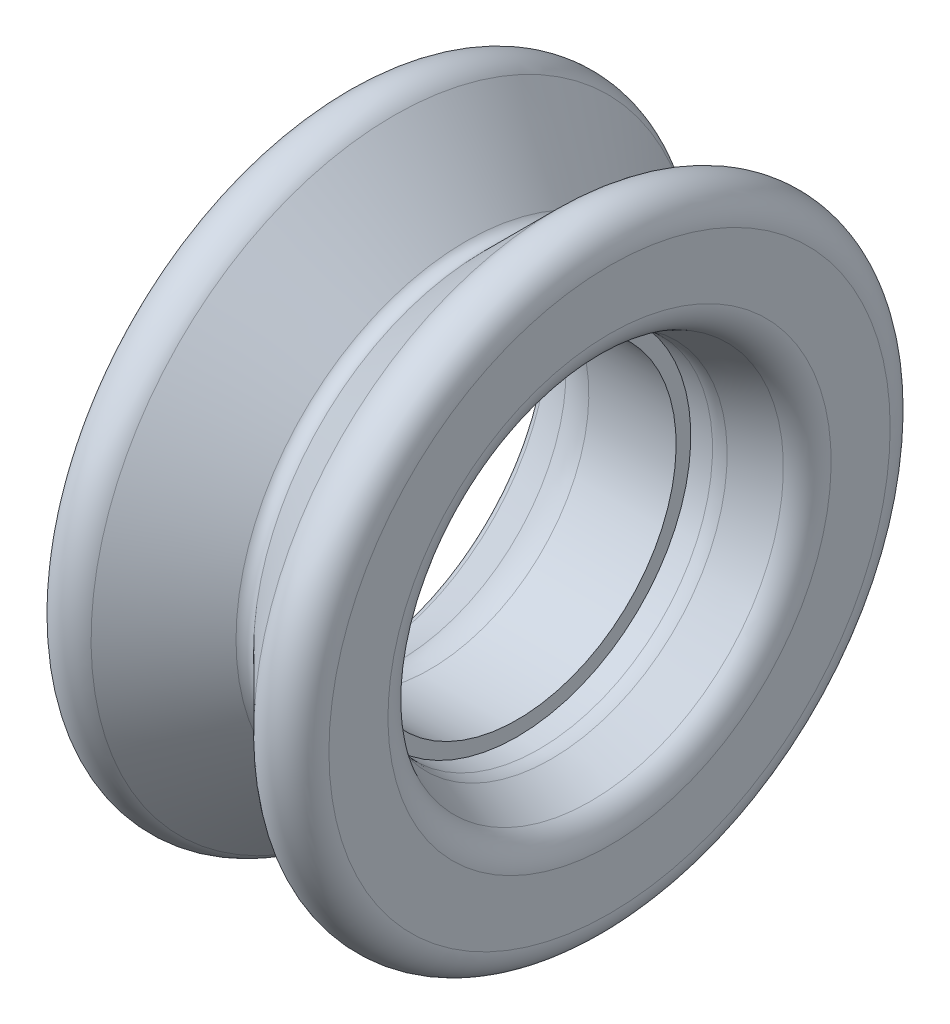
ISO-10303-21;
HEADER;
FILE_DESCRIPTION(('STEP AP214'),'2;1');
FILE_NAME('part.step','',(''),(''),'','','');
FILE_SCHEMA(('AUTOMOTIVE_DESIGN { 1 0 10303 214 1 1 1 1 }'));
ENDSEC;
DATA;
#1=APPLICATION_CONTEXT('core data for automotive mechanical design processes');
#2=APPLICATION_PROTOCOL_DEFINITION('international standard','automotive_design',2000,#1);
#3=PRODUCT_CONTEXT('',#1,'mechanical');
#4=PRODUCT('Part','Part','',(#3));
#5=PRODUCT_RELATED_PRODUCT_CATEGORY('part','',(#4));
#6=PRODUCT_DEFINITION_FORMATION('','',#4);
#7=PRODUCT_DEFINITION_CONTEXT('part definition',#1,'design');
#8=PRODUCT_DEFINITION('design','',#6,#7);
#9=PRODUCT_DEFINITION_SHAPE('','',#8);
#10=(LENGTH_UNIT() NAMED_UNIT(*) SI_UNIT(.MILLI.,.METRE.));
#11=(NAMED_UNIT(*) PLANE_ANGLE_UNIT() SI_UNIT($,.RADIAN.));
#12=(NAMED_UNIT(*) SI_UNIT($,.STERADIAN.) SOLID_ANGLE_UNIT());
#13=UNCERTAINTY_MEASURE_WITH_UNIT(LENGTH_MEASURE(1.E-05),#10,'distance_accuracy_value','');
#14=(GEOMETRIC_REPRESENTATION_CONTEXT(3) GLOBAL_UNCERTAINTY_ASSIGNED_CONTEXT((#13)) GLOBAL_UNIT_ASSIGNED_CONTEXT((#10,
#11,#12)) REPRESENTATION_CONTEXT('',''));
#15=CARTESIAN_POINT('',(0.,0.,0.));
#16=DIRECTION('',(0.,0.,1.));
#17=DIRECTION('',(1.,0.,0.));
#18=AXIS2_PLACEMENT_3D('',#15,#16,#17);
#19=CARTESIAN_POINT('',(-1.143,6.477,0.));
#20=DIRECTION('',(1.,0.,0.));
#21=DIRECTION('',(0.,1.,0.));
#22=AXIS2_PLACEMENT_3D('',#19,#20,#21);
#23=PLANE('',#22);
#24=CARTESIAN_POINT('',(-1.143,0.,0.));
#25=DIRECTION('',(1.,0.,0.));
#26=DIRECTION('',(0.,1.,0.));
#27=AXIS2_PLACEMENT_3D('',#24,#25,#26);
#28=CIRCLE('',#27,7.0739);
#29=CARTESIAN_POINT('',(-1.143,7.0739,0.));
#30=VERTEX_POINT('',#29);
#31=EDGE_CURVE('E84',#30,#30,#28,.T.);
#32=ORIENTED_EDGE('',*,*,#31,.T.);
#33=EDGE_LOOP('',(#32));
#34=FACE_BOUND('',#33,.T.);
#35=CARTESIAN_POINT('',(-1.143,0.,0.));
#36=DIRECTION('',(1.,0.,0.));
#37=DIRECTION('',(0.,1.,0.));
#38=AXIS2_PLACEMENT_3D('',#35,#36,#37);
#39=CIRCLE('',#38,6.477);
#40=CARTESIAN_POINT('',(-1.143,6.477,0.));
#41=VERTEX_POINT('',#40);
#42=EDGE_CURVE('E57',#41,#41,#39,.T.);
#43=ORIENTED_EDGE('',*,*,#42,.F.);
#44=EDGE_LOOP('',(#43));
#45=FACE_BOUND('',#44,.T.);
#46=ADVANCED_FACE('F31',(#34,#45),#23,.T.);
#47=CARTESIAN_POINT('',(0.,0.,0.));
#48=DIRECTION('',(1.,0.,0.));
#49=DIRECTION('',(0.,1.,0.));
#50=AXIS2_PLACEMENT_3D('',#47,#48,#49);
#51=CYLINDRICAL_SURFACE('',#50,6.477);
#52=ORIENTED_EDGE('',*,*,#42,.T.);
#53=EDGE_LOOP('',(#52));
#54=FACE_BOUND('',#53,.T.);
#55=CARTESIAN_POINT('',(-4.699,0.,0.));
#56=DIRECTION('',(1.,0.,0.));
#57=DIRECTION('',(0.,1.,0.));
#58=AXIS2_PLACEMENT_3D('',#55,#56,#57);
#59=CIRCLE('',#58,6.477);
#60=CARTESIAN_POINT('',(-4.699,6.477,0.));
#61=VERTEX_POINT('',#60);
#62=EDGE_CURVE('E60',#61,#61,#59,.T.);
#63=ORIENTED_EDGE('',*,*,#62,.F.);
#64=EDGE_LOOP('',(#63));
#65=FACE_BOUND('',#64,.T.);
#66=ADVANCED_FACE('F105',(#54,#65),#51,.F.);
#67=CARTESIAN_POINT('',(-4.699,0.,0.));
#68=DIRECTION('',(1.,0.,0.));
#69=DIRECTION('',(0.,1.,0.));
#70=AXIS2_PLACEMENT_3D('',#67,#68,#69);
#71=TOROIDAL_SURFACE('',#70,9.017,2.54);
#72=ORIENTED_EDGE('',*,*,#62,.T.);
#73=EDGE_LOOP('',(#72));
#74=FACE_BOUND('',#73,.T.);
#75=CARTESIAN_POINT('',(-5.969,0.,0.));
#76=DIRECTION('',(1.,0.,0.));
#77=DIRECTION('',(0.,1.,0.));
#78=AXIS2_PLACEMENT_3D('',#75,#76,#77);
#79=CIRCLE('',#78,6.81729547438753);
#80=CARTESIAN_POINT('',(-5.969,6.81729547438753,0.));
#81=VERTEX_POINT('',#80);
#82=EDGE_CURVE('E63',#81,#81,#79,.T.);
#83=ORIENTED_EDGE('',*,*,#82,.F.);
#84=EDGE_LOOP('',(#83));
#85=FACE_BOUND('',#84,.T.);
#86=ADVANCED_FACE('F110',(#74,#85),#71,.T.);
#87=CARTESIAN_POINT('',(-8.33655122421382,0.,0.));
#88=DIRECTION('',(-1.,0.,0.));
#89=DIRECTION('',(0.,-1.,0.));
#90=AXIS2_PLACEMENT_3D('',#87,#88,#89);
#91=CONICAL_SURFACE('',#90,8.18420181100761,0.5235987755983);
#92=CARTESIAN_POINT('',(-7.70155122421382,0.,0.));
#93=DIRECTION('',(1.,0.,0.));
#94=DIRECTION('',(0.,1.,0.));
#95=AXIS2_PLACEMENT_3D('',#92,#93,#94);
#96=CIRCLE('',#95,7.8175843900722);
#97=CARTESIAN_POINT('',(-7.70155122421382,7.8175843900722,0.));
#98=VERTEX_POINT('',#97);
#99=EDGE_CURVE('E42',#98,#98,#96,.F.);
#100=ORIENTED_EDGE('',*,*,#99,.T.);
#101=EDGE_LOOP('',(#100));
#102=FACE_BOUND('',#101,.T.);
#103=ORIENTED_EDGE('',*,*,#82,.T.);
#104=EDGE_LOOP('',(#103));
#105=FACE_BOUND('',#104,.T.);
#106=ADVANCED_FACE('F128',(#102,#105),#91,.F.);
#107=CARTESIAN_POINT('',(-8.33655122421382,11.43,0.));
#108=DIRECTION('',(-1.,0.,0.));
#109=DIRECTION('',(0.,-1.,0.));
#110=AXIS2_PLACEMENT_3D('',#107,#108,#109);
#111=PLANE('',#110);
#112=CARTESIAN_POINT('',(-8.33655122421382,0.,0.));
#113=DIRECTION('',(-1.,0.,0.));
#114=DIRECTION('',(0.,-1.,0.));
#115=AXIS2_PLACEMENT_3D('',#112,#113,#114);
#116=CIRCLE('',#115,8.91743665287843);
#117=CARTESIAN_POINT('',(-8.33655122421382,-8.91743665287844,0.));
#118=VERTEX_POINT('',#117);
#119=EDGE_CURVE('E46',#118,#118,#116,.F.);
#120=ORIENTED_EDGE('',*,*,#119,.T.);
#121=EDGE_LOOP('',(#120));
#122=FACE_BOUND('',#121,.T.);
#123=CARTESIAN_POINT('',(-8.33655122421382,0.,0.));
#124=DIRECTION('',(1.,0.,0.));
#125=DIRECTION('',(0.,1.,0.));
#126=AXIS2_PLACEMENT_3D('',#123,#124,#125);
#127=CIRCLE('',#126,11.43);
#128=CARTESIAN_POINT('',(-8.33655122421382,11.43,0.));
#129=VERTEX_POINT('',#128);
#130=EDGE_CURVE('E66',#129,#129,#127,.T.);
#131=ORIENTED_EDGE('',*,*,#130,.F.);
#132=EDGE_LOOP('',(#131));
#133=FACE_BOUND('',#132,.T.);
#134=ADVANCED_FACE('F124',(#122,#133),#111,.T.);
#135=CARTESIAN_POINT('',(-7.06655122421382,0.,0.));
#136=DIRECTION('',(1.,0.,0.));
#137=DIRECTION('',(0.,1.,0.));
#138=AXIS2_PLACEMENT_3D('',#135,#136,#137);
#139=TOROIDAL_SURFACE('',#138,11.43,1.27);
#140=ORIENTED_EDGE('',*,*,#130,.T.);
#141=EDGE_LOOP('',(#140));
#142=FACE_BOUND('',#141,.T.);
#143=CARTESIAN_POINT('',(-6.1685256121069,0.,0.));
#144=DIRECTION('',(1.,0.,0.));
#145=DIRECTION('',(0.,1.,0.));
#146=AXIS2_PLACEMENT_3D('',#143,#144,#145);
#147=CIRCLE('',#146,12.3280256121069);
#148=CARTESIAN_POINT('',(-6.1685256121069,12.3280256121069,0.));
#149=VERTEX_POINT('',#148);
#150=EDGE_CURVE('E69',#149,#149,#147,.T.);
#151=ORIENTED_EDGE('',*,*,#150,.F.);
#152=EDGE_LOOP('',(#151));
#153=FACE_BOUND('',#152,.T.);
#154=ADVANCED_FACE('F127',(#142,#153),#139,.T.);
#155=CARTESIAN_POINT('',(-3.21671024484277,0.,0.));
#156=DIRECTION('',(-1.,0.,0.));
#157=DIRECTION('',(0.,-1.,0.));
#158=AXIS2_PLACEMENT_3D('',#155,#156,#157);
#159=CONICAL_SURFACE('',#158,9.37621024484277,0.78539816339745);
#160=ORIENTED_EDGE('',*,*,#150,.T.);
#161=EDGE_LOOP('',(#160));
#162=FACE_BOUND('',#161,.T.);
#163=CARTESIAN_POINT('',(-3.21671024484277,0.,0.));
#164=DIRECTION('',(1.,0.,0.));
#165=DIRECTION('',(0.,1.,0.));
#166=AXIS2_PLACEMENT_3D('',#163,#164,#165);
#167=CIRCLE('',#166,9.37621024484277);
#168=CARTESIAN_POINT('',(-3.21671024484277,9.37621024484277,0.));
#169=VERTEX_POINT('',#168);
#170=EDGE_CURVE('E72',#169,#169,#167,.T.);
#171=ORIENTED_EDGE('',*,*,#170,.F.);
#172=EDGE_LOOP('',(#171));
#173=FACE_BOUND('',#172,.T.);
#174=ADVANCED_FACE('F134',(#162,#173),#159,.T.);
#175=CARTESIAN_POINT('',(-2.8575,0.,0.));
#176=DIRECTION('',(1.,0.,0.));
#177=DIRECTION('',(0.,1.,0.));
#178=AXIS2_PLACEMENT_3D('',#175,#176,#177);
#179=TOROIDAL_SURFACE('',#178,9.73542048968553,0.508);
#180=ORIENTED_EDGE('',*,*,#170,.T.);
#181=EDGE_LOOP('',(#180));
#182=FACE_BOUND('',#181,.T.);
#183=CARTESIAN_POINT('',(-2.49828975515723,0.,0.));
#184=DIRECTION('',(1.,0.,0.));
#185=DIRECTION('',(0.,1.,0.));
#186=AXIS2_PLACEMENT_3D('',#183,#184,#185);
#187=CIRCLE('',#186,9.37621024484277);
#188=CARTESIAN_POINT('',(-2.49828975515723,9.37621024484277,0.));
#189=VERTEX_POINT('',#188);
#190=EDGE_CURVE('E75',#189,#189,#187,.T.);
#191=ORIENTED_EDGE('',*,*,#190,.F.);
#192=EDGE_LOOP('',(#191));
#193=FACE_BOUND('',#192,.T.);
#194=ADVANCED_FACE('F140',(#182,#193),#179,.F.);
#195=CARTESIAN_POINT('',(0.453525612106907,0.,0.));
#196=DIRECTION('',(1.,0.,0.));
#197=DIRECTION('',(0.,1.,0.));
#198=AXIS2_PLACEMENT_3D('',#195,#196,#197);
#199=CONICAL_SURFACE('',#198,12.3280256121069,0.785398163397449);
#200=ORIENTED_EDGE('',*,*,#190,.T.);
#201=EDGE_LOOP('',(#200));
#202=FACE_BOUND('',#201,.T.);
#203=CARTESIAN_POINT('',(0.453525612106907,0.,0.));
#204=DIRECTION('',(1.,0.,0.));
#205=DIRECTION('',(0.,1.,0.));
#206=AXIS2_PLACEMENT_3D('',#203,#204,#205);
#207=CIRCLE('',#206,12.3280256121069);
#208=CARTESIAN_POINT('',(0.453525612106904,12.3280256121069,0.));
#209=VERTEX_POINT('',#208);
#210=EDGE_CURVE('E78',#209,#209,#207,.T.);
#211=ORIENTED_EDGE('',*,*,#210,.F.);
#212=EDGE_LOOP('',(#211));
#213=FACE_BOUND('',#212,.T.);
#214=ADVANCED_FACE('F146',(#202,#213),#199,.T.);
#215=CARTESIAN_POINT('',(1.35155122421382,0.,0.));
#216=DIRECTION('',(1.,0.,0.));
#217=DIRECTION('',(0.,1.,0.));
#218=AXIS2_PLACEMENT_3D('',#215,#216,#217);
#219=TOROIDAL_SURFACE('',#218,11.43,1.27);
#220=ORIENTED_EDGE('',*,*,#210,.T.);
#221=EDGE_LOOP('',(#220));
#222=FACE_BOUND('',#221,.T.);
#223=CARTESIAN_POINT('',(2.62155122421382,0.,0.));
#224=DIRECTION('',(1.,0.,0.));
#225=DIRECTION('',(0.,1.,0.));
#226=AXIS2_PLACEMENT_3D('',#223,#224,#225);
#227=CIRCLE('',#226,11.43);
#228=CARTESIAN_POINT('',(2.62155122421382,11.43,0.));
#229=VERTEX_POINT('',#228);
#230=EDGE_CURVE('E81',#229,#229,#227,.T.);
#231=ORIENTED_EDGE('',*,*,#230,.F.);
#232=EDGE_LOOP('',(#231));
#233=FACE_BOUND('',#232,.T.);
#234=ADVANCED_FACE('F152',(#222,#233),#219,.T.);
#235=CARTESIAN_POINT('',(2.62155122421382,8.18420181100761,0.));
#236=DIRECTION('',(1.,0.,0.));
#237=DIRECTION('',(0.,1.,0.));
#238=AXIS2_PLACEMENT_3D('',#235,#236,#237);
#239=PLANE('',#238);
#240=CARTESIAN_POINT('',(2.62155122421382,0.,0.));
#241=DIRECTION('',(1.,0.,0.));
#242=DIRECTION('',(0.,1.,0.));
#243=AXIS2_PLACEMENT_3D('',#240,#241,#242);
#244=CIRCLE('',#243,9.02552910457492);
#245=CARTESIAN_POINT('',(2.62155122421382,9.02552910457492,0.));
#246=VERTEX_POINT('',#245);
#247=EDGE_CURVE('E51',#246,#246,#244,.F.);
#248=ORIENTED_EDGE('',*,*,#247,.T.);
#249=EDGE_LOOP('',(#248));
#250=FACE_BOUND('',#249,.T.);
#251=ORIENTED_EDGE('',*,*,#230,.T.);
#252=EDGE_LOOP('',(#251));
#253=FACE_BOUND('',#252,.T.);
#254=ADVANCED_FACE('F102',(#250,#253),#239,.T.);
#255=CARTESIAN_POINT('',(0.,0.,0.));
#256=DIRECTION('',(1.,0.,0.));
#257=DIRECTION('',(0.,1.,0.));
#258=AXIS2_PLACEMENT_3D('',#255,#256,#257);
#259=CONICAL_SURFACE('',#258,7.0739,0.400623663375853);
#260=CARTESIAN_POINT('',(0.237436656481613,0.,0.));
#261=DIRECTION('',(-1.,0.,0.));
#262=DIRECTION('',(0.,-1.,0.));
#263=AXIS2_PLACEMENT_3D('',#260,#261,#262);
#264=CIRCLE('',#263,7.17446120485312);
#265=CARTESIAN_POINT('',(0.237436656481614,-7.17446120485312,0.));
#266=VERTEX_POINT('',#265);
#267=EDGE_CURVE('E10',#266,#266,#264,.T.);
#268=ORIENTED_EDGE('',*,*,#267,.T.);
#269=EDGE_LOOP('',(#268));
#270=FACE_BOUND('',#269,.T.);
#271=CARTESIAN_POINT('',(1.84684195136851,0.,0.));
#272=DIRECTION('',(-1.,0.,0.));
#273=DIRECTION('',(0.,-1.,0.));
#274=AXIS2_PLACEMENT_3D('',#271,#272,#273);
#275=CIRCLE('',#274,7.85609030942805);
#276=CARTESIAN_POINT('',(1.84684195136852,-7.85609030942805,0.));
#277=VERTEX_POINT('',#276);
#278=EDGE_CURVE('E54',#277,#277,#275,.F.);
#279=ORIENTED_EDGE('',*,*,#278,.T.);
#280=EDGE_LOOP('',(#279));
#281=FACE_BOUND('',#280,.T.);
#282=ADVANCED_FACE('F93',(#270,#281),#259,.F.);
#283=CARTESIAN_POINT('',(0.,0.,0.));
#284=DIRECTION('',(1.,0.,0.));
#285=DIRECTION('',(0.,1.,0.));
#286=AXIS2_PLACEMENT_3D('',#283,#284,#285);
#287=CYLINDRICAL_SURFACE('',#286,7.0739);
#288=CARTESIAN_POINT('',(-0.257854070673078,0.,0.));
#289=DIRECTION('',(-1.,0.,0.));
#290=DIRECTION('',(0.,-1.,0.));
#291=AXIS2_PLACEMENT_3D('',#288,#289,#290);
#292=CIRCLE('',#291,7.0739);
#293=CARTESIAN_POINT('',(-0.257854070673077,-7.0739,0.));
#294=VERTEX_POINT('',#293);
#295=EDGE_CURVE('E38',#294,#294,#292,.F.);
#296=ORIENTED_EDGE('',*,*,#295,.T.);
#297=EDGE_LOOP('',(#296));
#298=FACE_BOUND('',#297,.T.);
#299=ORIENTED_EDGE('',*,*,#31,.F.);
#300=EDGE_LOOP('',(#299));
#301=FACE_BOUND('',#300,.T.);
#302=ADVANCED_FACE('F90',(#298,#301),#287,.F.);
#303=CARTESIAN_POINT('',(1.35155122421382,0.,0.));
#304=DIRECTION('',(1.,0.,0.));
#305=DIRECTION('',(0.,1.,0.));
#306=AXIS2_PLACEMENT_3D('',#303,#304,#305);
#307=TOROIDAL_SURFACE('',#306,9.02552910457492,1.27);
#308=ORIENTED_EDGE('',*,*,#247,.F.);
#309=EDGE_LOOP('',(#308));
#310=FACE_BOUND('',#309,.T.);
#311=ORIENTED_EDGE('',*,*,#278,.F.);
#312=EDGE_LOOP('',(#311));
#313=FACE_BOUND('',#312,.T.);
#314=ADVANCED_FACE('F92',(#310,#313),#307,.T.);
#315=CARTESIAN_POINT('',(-7.06655122421382,0.,0.));
#316=DIRECTION('',(-1.,0.,0.));
#317=DIRECTION('',(0.,-1.,0.));
#318=AXIS2_PLACEMENT_3D('',#315,#316,#317);
#319=TOROIDAL_SURFACE('',#318,8.91743665287843,1.27);
#320=ORIENTED_EDGE('',*,*,#99,.F.);
#321=EDGE_LOOP('',(#320));
#322=FACE_BOUND('',#321,.T.);
#323=ORIENTED_EDGE('',*,*,#119,.F.);
#324=EDGE_LOOP('',(#323));
#325=FACE_BOUND('',#324,.T.);
#326=ADVANCED_FACE('F99',(#322,#325),#319,.T.);
#327=CARTESIAN_POINT('',(-0.257854070673078,0.,0.));
#328=DIRECTION('',(-1.,0.,0.));
#329=DIRECTION('',(0.,-1.,0.));
#330=AXIS2_PLACEMENT_3D('',#327,#328,#329);
#331=TOROIDAL_SURFACE('',#330,8.3439,1.27);
#332=ORIENTED_EDGE('',*,*,#267,.F.);
#333=EDGE_LOOP('',(#332));
#334=FACE_BOUND('',#333,.T.);
#335=ORIENTED_EDGE('',*,*,#295,.F.);
#336=EDGE_LOOP('',(#335));
#337=FACE_BOUND('',#336,.T.);
#338=ADVANCED_FACE('F33',(#334,#337),#331,.T.);
#339=CLOSED_SHELL('',(#46,#66,#86,#106,#134,#154,#174,#194,#214,#234,#254,#282,#302,#314,#326,#338));
#340=MANIFOLD_SOLID_BREP('B2',#339);
#341=ADVANCED_BREP_SHAPE_REPRESENTATION('',(#18,#340),#14);
#342=SHAPE_DEFINITION_REPRESENTATION(#9,#341);
ENDSEC;
END-ISO-10303-21;
